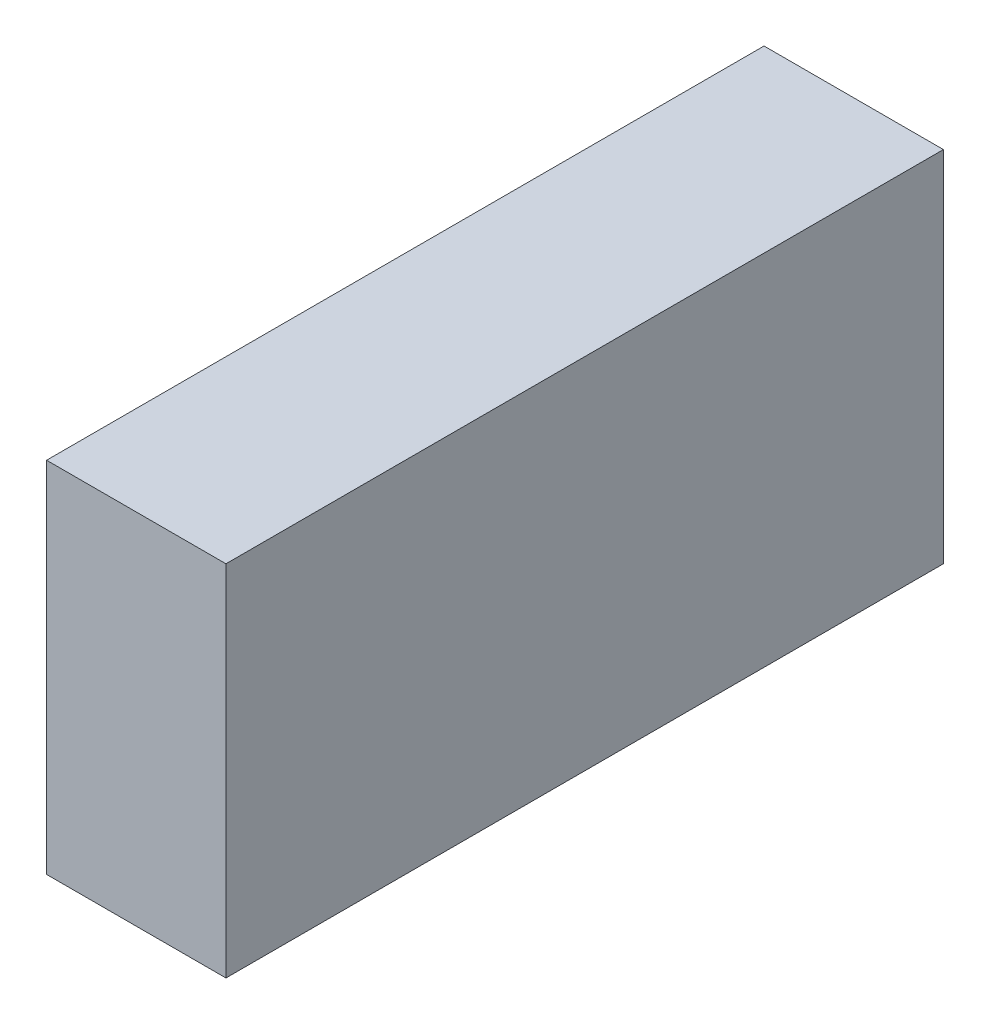
ISO-10303-21;
HEADER;
FILE_DESCRIPTION(('STEP AP214'),'2;1');
FILE_NAME('part.step','',(''),(''),'','','');
FILE_SCHEMA(('AUTOMOTIVE_DESIGN { 1 0 10303 214 1 1 1 1 }'));
ENDSEC;
DATA;
#1=APPLICATION_CONTEXT('core data for automotive mechanical design processes');
#2=APPLICATION_PROTOCOL_DEFINITION('international standard','automotive_design',2000,#1);
#3=PRODUCT_CONTEXT('',#1,'mechanical');
#4=PRODUCT('Part','Part','',(#3));
#5=PRODUCT_RELATED_PRODUCT_CATEGORY('part','',(#4));
#6=PRODUCT_DEFINITION_FORMATION('','',#4);
#7=PRODUCT_DEFINITION_CONTEXT('part definition',#1,'design');
#8=PRODUCT_DEFINITION('design','',#6,#7);
#9=PRODUCT_DEFINITION_SHAPE('','',#8);
#10=(LENGTH_UNIT() NAMED_UNIT(*) SI_UNIT(.MILLI.,.METRE.));
#11=(NAMED_UNIT(*) PLANE_ANGLE_UNIT() SI_UNIT($,.RADIAN.));
#12=(NAMED_UNIT(*) SI_UNIT($,.STERADIAN.) SOLID_ANGLE_UNIT());
#13=UNCERTAINTY_MEASURE_WITH_UNIT(LENGTH_MEASURE(1.E-05),#10,'distance_accuracy_value','');
#14=(GEOMETRIC_REPRESENTATION_CONTEXT(3) GLOBAL_UNCERTAINTY_ASSIGNED_CONTEXT((#13)) GLOBAL_UNIT_ASSIGNED_CONTEXT((#10,
#11,#12)) REPRESENTATION_CONTEXT('',''));
#15=CARTESIAN_POINT('',(0.,0.,0.));
#16=DIRECTION('',(0.,0.,1.));
#17=DIRECTION('',(1.,0.,0.));
#18=AXIS2_PLACEMENT_3D('',#15,#16,#17);
#19=CARTESIAN_POINT('',(0.79375,1.5875,3.175));
#20=DIRECTION('',(0.,0.,-1.));
#21=DIRECTION('',(-1.,0.,0.));
#22=AXIS2_PLACEMENT_3D('',#19,#20,#21);
#23=PLANE('',#22);
#24=DIRECTION('',(0.,-1.,0.));
#25=VECTOR('',#24,1.);
#26=CARTESIAN_POINT('',(-0.79375,1.5875,3.175));
#27=LINE('',#26,#25);
#28=CARTESIAN_POINT('',(-0.79375,1.5875,3.175));
#29=VERTEX_POINT('',#28);
#30=CARTESIAN_POINT('',(-0.79375,-1.5875,3.175));
#31=VERTEX_POINT('',#30);
#32=EDGE_CURVE('E416',#29,#31,#27,.T.);
#33=ORIENTED_EDGE('',*,*,#32,.T.);
#34=DIRECTION('',(-1.,0.,0.));
#35=VECTOR('',#34,1.);
#36=CARTESIAN_POINT('',(0.79375,-1.5875,3.175));
#37=LINE('',#36,#35);
#38=CARTESIAN_POINT('',(0.79375,-1.5875,3.175));
#39=VERTEX_POINT('',#38);
#40=EDGE_CURVE('E11',#39,#31,#37,.T.);
#41=ORIENTED_EDGE('',*,*,#40,.F.);
#42=DIRECTION('',(0.,-1.,0.));
#43=VECTOR('',#42,1.);
#44=CARTESIAN_POINT('',(0.79375,1.5875,3.175));
#45=LINE('',#44,#43);
#46=CARTESIAN_POINT('',(0.79375,1.5875,3.175));
#47=VERTEX_POINT('',#46);
#48=EDGE_CURVE('E434',#47,#39,#45,.T.);
#49=ORIENTED_EDGE('',*,*,#48,.F.);
#50=DIRECTION('',(-1.,0.,0.));
#51=VECTOR('',#50,1.);
#52=CARTESIAN_POINT('',(0.79375,1.5875,3.175));
#53=LINE('',#52,#51);
#54=EDGE_CURVE('E428',#47,#29,#53,.T.);
#55=ORIENTED_EDGE('',*,*,#54,.T.);
#56=EDGE_LOOP('',(#33,#41,#49,#55));
#57=FACE_BOUND('',#56,.T.);
#58=ADVANCED_FACE('F372',(#57),#23,.F.);
#59=CARTESIAN_POINT('',(0.79375,-1.5875,3.175));
#60=DIRECTION('',(0.,1.,0.));
#61=DIRECTION('',(0.,0.,1.));
#62=AXIS2_PLACEMENT_3D('',#59,#60,#61);
#63=PLANE('',#62);
#64=DIRECTION('',(0.,0.,-1.));
#65=VECTOR('',#64,1.);
#66=CARTESIAN_POINT('',(-0.79375,-1.5875,3.175));
#67=LINE('',#66,#65);
#68=CARTESIAN_POINT('',(-0.79375,-1.5875,-3.175));
#69=VERTEX_POINT('',#68);
#70=EDGE_CURVE('E412',#31,#69,#67,.T.);
#71=ORIENTED_EDGE('',*,*,#70,.T.);
#72=DIRECTION('',(-1.,0.,0.));
#73=VECTOR('',#72,1.);
#74=CARTESIAN_POINT('',(0.79375,-1.5875,-3.175));
#75=LINE('',#74,#73);
#76=CARTESIAN_POINT('',(0.79375,-1.5875,-3.175));
#77=VERTEX_POINT('',#76);
#78=EDGE_CURVE('E379',#77,#69,#75,.T.);
#79=ORIENTED_EDGE('',*,*,#78,.F.);
#80=DIRECTION('',(0.,0.,-1.));
#81=VECTOR('',#80,1.);
#82=CARTESIAN_POINT('',(0.79375,-1.5875,3.175));
#83=LINE('',#82,#81);
#84=EDGE_CURVE('E424',#39,#77,#83,.T.);
#85=ORIENTED_EDGE('',*,*,#84,.F.);
#86=ORIENTED_EDGE('',*,*,#40,.T.);
#87=EDGE_LOOP('',(#71,#79,#85,#86));
#88=FACE_BOUND('',#87,.T.);
#89=ADVANCED_FACE('F423',(#88),#63,.F.);
#90=CARTESIAN_POINT('',(0.79375,1.5875,-3.175));
#91=DIRECTION('',(0.,0.,1.));
#92=DIRECTION('',(1.,0.,0.));
#93=AXIS2_PLACEMENT_3D('',#90,#91,#92);
#94=PLANE('',#93);
#95=DIRECTION('',(0.,1.,0.));
#96=VECTOR('',#95,1.);
#97=CARTESIAN_POINT('',(-0.79375,1.5875,-3.175));
#98=LINE('',#97,#96);
#99=CARTESIAN_POINT('',(-0.79375,1.5875,-3.175));
#100=VERTEX_POINT('',#99);
#101=EDGE_CURVE('E417',#69,#100,#98,.T.);
#102=ORIENTED_EDGE('',*,*,#101,.T.);
#103=DIRECTION('',(-1.,0.,0.));
#104=VECTOR('',#103,1.);
#105=CARTESIAN_POINT('',(0.79375,1.5875,-3.175));
#106=LINE('',#105,#104);
#107=CARTESIAN_POINT('',(0.79375,1.5875,-3.175));
#108=VERTEX_POINT('',#107);
#109=EDGE_CURVE('E440',#108,#100,#106,.T.);
#110=ORIENTED_EDGE('',*,*,#109,.F.);
#111=DIRECTION('',(0.,1.,0.));
#112=VECTOR('',#111,1.);
#113=CARTESIAN_POINT('',(0.79375,1.5875,-3.175));
#114=LINE('',#113,#112);
#115=EDGE_CURVE('E391',#77,#108,#114,.T.);
#116=ORIENTED_EDGE('',*,*,#115,.F.);
#117=ORIENTED_EDGE('',*,*,#78,.T.);
#118=EDGE_LOOP('',(#102,#110,#116,#117));
#119=FACE_BOUND('',#118,.T.);
#120=ADVANCED_FACE('F443',(#119),#94,.F.);
#121=CARTESIAN_POINT('',(0.79375,1.5875,3.175));
#122=DIRECTION('',(0.,-1.,0.));
#123=DIRECTION('',(0.,0.,-1.));
#124=AXIS2_PLACEMENT_3D('',#121,#122,#123);
#125=PLANE('',#124);
#126=DIRECTION('',(0.,0.,1.));
#127=VECTOR('',#126,1.);
#128=CARTESIAN_POINT('',(-0.79375,1.5875,3.175));
#129=LINE('',#128,#127);
#130=EDGE_CURVE('E432',#100,#29,#129,.T.);
#131=ORIENTED_EDGE('',*,*,#130,.T.);
#132=ORIENTED_EDGE('',*,*,#54,.F.);
#133=DIRECTION('',(0.,0.,1.));
#134=VECTOR('',#133,1.);
#135=CARTESIAN_POINT('',(0.79375,1.5875,3.175));
#136=LINE('',#135,#134);
#137=EDGE_CURVE('E386',#108,#47,#136,.T.);
#138=ORIENTED_EDGE('',*,*,#137,.F.);
#139=ORIENTED_EDGE('',*,*,#109,.T.);
#140=EDGE_LOOP('',(#131,#132,#138,#139));
#141=FACE_BOUND('',#140,.T.);
#142=ADVANCED_FACE('F445',(#141),#125,.F.);
#143=CARTESIAN_POINT('',(0.79375,-1.5875,3.175));
#144=DIRECTION('',(1.,0.,0.));
#145=DIRECTION('',(0.,0.,-1.));
#146=AXIS2_PLACEMENT_3D('',#143,#144,#145);
#147=PLANE('',#146);
#148=ORIENTED_EDGE('',*,*,#48,.T.);
#149=ORIENTED_EDGE('',*,*,#84,.T.);
#150=ORIENTED_EDGE('',*,*,#115,.T.);
#151=ORIENTED_EDGE('',*,*,#137,.T.);
#152=EDGE_LOOP('',(#148,#149,#150,#151));
#153=FACE_BOUND('',#152,.T.);
#154=ADVANCED_FACE('F446',(#153),#147,.T.);
#155=CARTESIAN_POINT('',(-0.79375,-1.5875,3.175));
#156=DIRECTION('',(1.,0.,0.));
#157=DIRECTION('',(0.,0.,-1.));
#158=AXIS2_PLACEMENT_3D('',#155,#156,#157);
#159=PLANE('',#158);
#160=ORIENTED_EDGE('',*,*,#32,.F.);
#161=ORIENTED_EDGE('',*,*,#130,.F.);
#162=ORIENTED_EDGE('',*,*,#101,.F.);
#163=ORIENTED_EDGE('',*,*,#70,.F.);
#164=EDGE_LOOP('',(#160,#161,#162,#163));
#165=FACE_BOUND('',#164,.T.);
#166=ADVANCED_FACE('F413',(#165),#159,.F.);
#167=CLOSED_SHELL('',(#58,#89,#120,#142,#154,#166));
#168=MANIFOLD_SOLID_BREP('B2',#167);
#169=ADVANCED_BREP_SHAPE_REPRESENTATION('',(#18,#168),#14);
#170=SHAPE_DEFINITION_REPRESENTATION(#9,#169);
ENDSEC;
END-ISO-10303-21;
